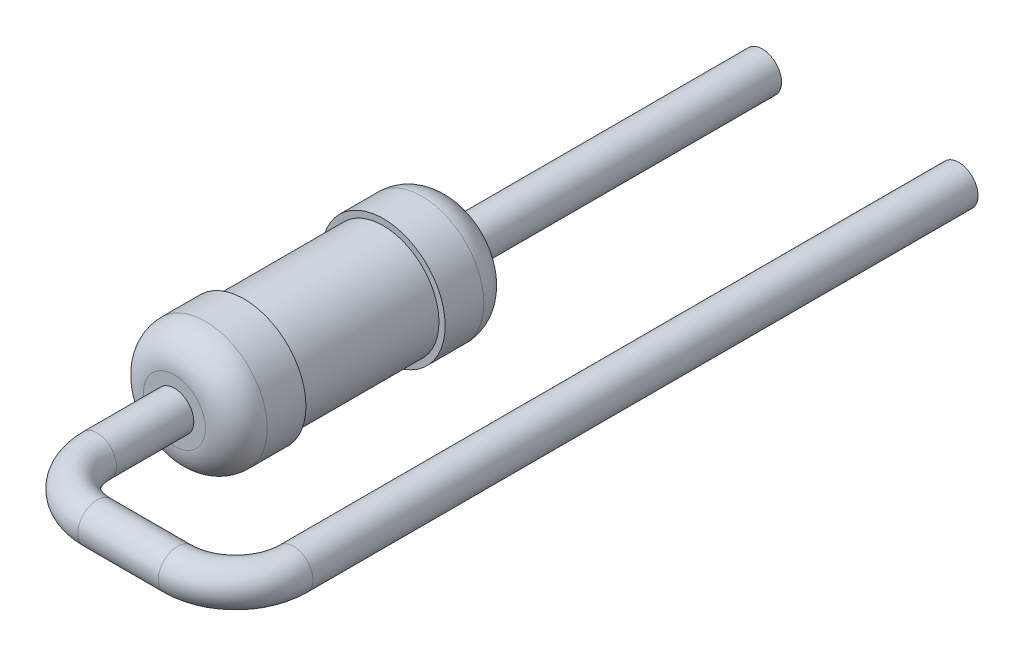
ISO-10303-21;
HEADER;
FILE_DESCRIPTION(('STEP AP214'),'2;1');
FILE_NAME('part.step','',(''),(''),'','','');
FILE_SCHEMA(('AUTOMOTIVE_DESIGN { 1 0 10303 214 1 1 1 1 }'));
ENDSEC;
DATA;
#1=APPLICATION_CONTEXT('core data for automotive mechanical design processes');
#2=APPLICATION_PROTOCOL_DEFINITION('international standard','automotive_design',2000,#1);
#3=PRODUCT_CONTEXT('',#1,'mechanical');
#4=PRODUCT('Part','Part','',(#3));
#5=PRODUCT_RELATED_PRODUCT_CATEGORY('part','',(#4));
#6=PRODUCT_DEFINITION_FORMATION('','',#4);
#7=PRODUCT_DEFINITION_CONTEXT('part definition',#1,'design');
#8=PRODUCT_DEFINITION('design','',#6,#7);
#9=PRODUCT_DEFINITION_SHAPE('','',#8);
#10=(LENGTH_UNIT() NAMED_UNIT(*) SI_UNIT(.MILLI.,.METRE.));
#11=(NAMED_UNIT(*) PLANE_ANGLE_UNIT() SI_UNIT($,.RADIAN.));
#12=(NAMED_UNIT(*) SI_UNIT($,.STERADIAN.) SOLID_ANGLE_UNIT());
#13=UNCERTAINTY_MEASURE_WITH_UNIT(LENGTH_MEASURE(1.E-05),#10,'distance_accuracy_value','');
#14=(GEOMETRIC_REPRESENTATION_CONTEXT(3) GLOBAL_UNCERTAINTY_ASSIGNED_CONTEXT((#13)) GLOBAL_UNIT_ASSIGNED_CONTEXT((#10,
#11,#12)) REPRESENTATION_CONTEXT('',''));
#15=CARTESIAN_POINT('',(0.,0.,0.));
#16=DIRECTION('',(0.,0.,1.));
#17=DIRECTION('',(1.,0.,0.));
#18=AXIS2_PLACEMENT_3D('',#15,#16,#17);
#19=CARTESIAN_POINT('',(2.29,0.,-3.));
#20=DIRECTION('',(0.,0.,1.));
#21=DIRECTION('',(1.,0.,0.));
#22=AXIS2_PLACEMENT_3D('',#19,#20,#21);
#23=PLANE('',#22);
#24=CARTESIAN_POINT('',(2.54,0.,-3.));
#25=DIRECTION('',(0.,0.,-1.));
#26=DIRECTION('',(-1.,0.,0.));
#27=AXIS2_PLACEMENT_3D('',#24,#25,#26);
#28=CIRCLE('',#27,0.25);
#29=CARTESIAN_POINT('',(2.29,0.,-3.));
#30=VERTEX_POINT('',#29);
#31=EDGE_CURVE('E11',#30,#30,#28,.T.);
#32=ORIENTED_EDGE('',*,*,#31,.T.);
#33=EDGE_LOOP('',(#32));
#34=FACE_BOUND('',#33,.T.);
#35=ADVANCED_FACE('F17',(#34),#23,.F.);
#36=CARTESIAN_POINT('',(2.54,0.,5.6));
#37=DIRECTION('',(0.,0.,-1.));
#38=DIRECTION('',(-1.,0.,0.));
#39=AXIS2_PLACEMENT_3D('',#36,#37,#38);
#40=CYLINDRICAL_SURFACE('',#39,0.25);
#41=DIRECTION('',(0.,0.,-1.));
#42=VECTOR('',#41,1.);
#43=CARTESIAN_POINT('',(2.29,0.,5.6));
#44=LINE('',#43,#42);
#45=CARTESIAN_POINT('',(2.29,0.,5.6));
#46=VERTEX_POINT('',#45);
#47=EDGE_CURVE('E21',#46,#30,#44,.T.);
#48=ORIENTED_EDGE('',*,*,#47,.T.);
#49=ORIENTED_EDGE('',*,*,#31,.F.);
#50=ORIENTED_EDGE('',*,*,#47,.F.);
#51=CARTESIAN_POINT('',(2.54,0.,5.6));
#52=DIRECTION('',(0.,0.,1.));
#53=DIRECTION('',(1.,0.,0.));
#54=AXIS2_PLACEMENT_3D('',#51,#52,#53);
#55=CIRCLE('',#54,0.25);
#56=EDGE_CURVE('E122',#46,#46,#55,.T.);
#57=ORIENTED_EDGE('',*,*,#56,.F.);
#58=EDGE_LOOP('',(#48,#49,#50,#57));
#59=FACE_BOUND('',#58,.T.);
#60=ADVANCED_FACE('F239',(#59),#40,.T.);
#61=CARTESIAN_POINT('',(1.79,0.,5.6));
#62=DIRECTION('',(0.,1.,0.));
#63=DIRECTION('',(0.,0.,1.));
#64=AXIS2_PLACEMENT_3D('',#61,#62,#63);
#65=TOROIDAL_SURFACE('',#64,0.75,0.25);
#66=CARTESIAN_POINT('',(1.79,0.,5.6));
#67=DIRECTION('',(0.,1.,0.));
#68=DIRECTION('',(0.,0.,1.));
#69=AXIS2_PLACEMENT_3D('',#66,#67,#68);
#70=CIRCLE('',#69,0.5);
#71=CARTESIAN_POINT('',(1.79,0.,6.1));
#72=VERTEX_POINT('',#71);
#73=EDGE_CURVE('E119',#72,#46,#70,.T.);
#74=ORIENTED_EDGE('',*,*,#73,.T.);
#75=ORIENTED_EDGE('',*,*,#56,.T.);
#76=ORIENTED_EDGE('',*,*,#73,.F.);
#77=CARTESIAN_POINT('',(1.79,0.,6.35));
#78=DIRECTION('',(1.,0.,0.));
#79=DIRECTION('',(0.,0.,-1.));
#80=AXIS2_PLACEMENT_3D('',#77,#78,#79);
#81=CIRCLE('',#80,0.25);
#82=EDGE_CURVE('E123',#72,#72,#81,.T.);
#83=ORIENTED_EDGE('',*,*,#82,.T.);
#84=EDGE_LOOP('',(#74,#75,#76,#83));
#85=FACE_BOUND('',#84,.T.);
#86=ADVANCED_FACE('F183',(#85),#65,.T.);
#87=CARTESIAN_POINT('',(0.75,0.,6.35));
#88=DIRECTION('',(1.,0.,0.));
#89=DIRECTION('',(0.,0.,-1.));
#90=AXIS2_PLACEMENT_3D('',#87,#88,#89);
#91=CYLINDRICAL_SURFACE('',#90,0.25);
#92=DIRECTION('',(1.,0.,0.));
#93=VECTOR('',#92,1.);
#94=CARTESIAN_POINT('',(0.75,0.,6.1));
#95=LINE('',#94,#93);
#96=CARTESIAN_POINT('',(0.75,0.,6.1));
#97=VERTEX_POINT('',#96);
#98=EDGE_CURVE('E166',#97,#72,#95,.T.);
#99=ORIENTED_EDGE('',*,*,#98,.T.);
#100=ORIENTED_EDGE('',*,*,#82,.F.);
#101=ORIENTED_EDGE('',*,*,#98,.F.);
#102=CARTESIAN_POINT('',(0.75,0.,6.35));
#103=DIRECTION('',(-1.,0.,0.));
#104=DIRECTION('',(0.,0.,1.));
#105=AXIS2_PLACEMENT_3D('',#102,#103,#104);
#106=CIRCLE('',#105,0.25);
#107=EDGE_CURVE('E162',#97,#97,#106,.T.);
#108=ORIENTED_EDGE('',*,*,#107,.F.);
#109=EDGE_LOOP('',(#99,#100,#101,#108));
#110=FACE_BOUND('',#109,.T.);
#111=ADVANCED_FACE('F185',(#110),#91,.T.);
#112=CARTESIAN_POINT('',(0.75,0.,5.6));
#113=DIRECTION('',(0.,1.,0.));
#114=DIRECTION('',(-1.,0.,0.));
#115=AXIS2_PLACEMENT_3D('',#112,#113,#114);
#116=TOROIDAL_SURFACE('',#115,0.75,0.25);
#117=CARTESIAN_POINT('',(0.75,0.,5.6));
#118=DIRECTION('',(0.,1.,0.));
#119=DIRECTION('',(-1.,0.,0.));
#120=AXIS2_PLACEMENT_3D('',#117,#118,#119);
#121=CIRCLE('',#120,0.5);
#122=CARTESIAN_POINT('',(0.25,0.,5.6));
#123=VERTEX_POINT('',#122);
#124=EDGE_CURVE('E135',#123,#97,#121,.T.);
#125=ORIENTED_EDGE('',*,*,#124,.T.);
#126=ORIENTED_EDGE('',*,*,#107,.T.);
#127=ORIENTED_EDGE('',*,*,#124,.F.);
#128=CARTESIAN_POINT('',(0.,0.,5.6));
#129=DIRECTION('',(0.,0.,1.));
#130=DIRECTION('',(1.,0.,0.));
#131=AXIS2_PLACEMENT_3D('',#128,#129,#130);
#132=CIRCLE('',#131,0.25);
#133=EDGE_CURVE('E132',#123,#123,#132,.T.);
#134=ORIENTED_EDGE('',*,*,#133,.T.);
#135=EDGE_LOOP('',(#125,#126,#127,#134));
#136=FACE_BOUND('',#135,.T.);
#137=ADVANCED_FACE('F188',(#136),#116,.T.);
#138=CARTESIAN_POINT('',(0.,0.,-3.));
#139=DIRECTION('',(0.,0.,1.));
#140=DIRECTION('',(1.,0.,0.));
#141=AXIS2_PLACEMENT_3D('',#138,#139,#140);
#142=CYLINDRICAL_SURFACE('',#141,0.25);
#143=CARTESIAN_POINT('',(0.,0.,4.6));
#144=DIRECTION('',(0.,0.,1.));
#145=DIRECTION('',(1.,0.,0.));
#146=AXIS2_PLACEMENT_3D('',#143,#144,#145);
#147=CIRCLE('',#146,0.25);
#148=CARTESIAN_POINT('',(0.25,0.,4.6));
#149=VERTEX_POINT('',#148);
#150=EDGE_CURVE('E152',#149,#149,#147,.T.);
#151=ORIENTED_EDGE('',*,*,#150,.T.);
#152=DIRECTION('',(0.,0.,1.));
#153=VECTOR('',#152,1.);
#154=CARTESIAN_POINT('',(0.25,0.,-3.));
#155=LINE('',#154,#153);
#156=EDGE_CURVE('E136',#149,#123,#155,.T.);
#157=ORIENTED_EDGE('',*,*,#156,.T.);
#158=ORIENTED_EDGE('',*,*,#133,.F.);
#159=ORIENTED_EDGE('',*,*,#156,.F.);
#160=EDGE_LOOP('',(#151,#157,#158,#159));
#161=FACE_BOUND('',#160,.T.);
#162=ADVANCED_FACE('F192',(#161),#142,.T.);
#163=CARTESIAN_POINT('',(0.8,0.,4.6));
#164=DIRECTION('',(0.,0.,-1.));
#165=DIRECTION('',(0.,-1.,0.));
#166=AXIS2_PLACEMENT_3D('',#163,#164,#165);
#167=PLANE('',#166);
#168=ORIENTED_EDGE('',*,*,#150,.F.);
#169=EDGE_LOOP('',(#168));
#170=FACE_BOUND('',#169,.T.);
#171=CARTESIAN_POINT('',(0.,0.,4.6));
#172=DIRECTION('',(0.,0.,1.));
#173=DIRECTION('',(1.,0.,0.));
#174=AXIS2_PLACEMENT_3D('',#171,#172,#173);
#175=CIRCLE('',#174,0.4);
#176=CARTESIAN_POINT('',(0.4,0.,4.6));
#177=VERTEX_POINT('',#176);
#178=EDGE_CURVE('E196',#177,#177,#175,.T.);
#179=ORIENTED_EDGE('',*,*,#178,.T.);
#180=EDGE_LOOP('',(#179));
#181=FACE_BOUND('',#180,.T.);
#182=ADVANCED_FACE('F260',(#170,#181),#167,.F.);
#183=CARTESIAN_POINT('',(0.,0.,4.2));
#184=DIRECTION('',(0.,0.,1.));
#185=DIRECTION('',(1.,0.,0.));
#186=AXIS2_PLACEMENT_3D('',#183,#184,#185);
#187=DEGENERATE_TOROIDAL_SURFACE('',#186,0.4,0.4,.T.);
#188=CARTESIAN_POINT('',(0.4,0.,4.2));
#189=DIRECTION('',(0.,-1.,0.));
#190=DIRECTION('',(1.,0.,0.));
#191=AXIS2_PLACEMENT_3D('',#188,#189,#190);
#192=CIRCLE('',#191,0.4);
#193=CARTESIAN_POINT('',(0.8,0.,4.2));
#194=VERTEX_POINT('',#193);
#195=EDGE_CURVE('E171',#194,#177,#192,.T.);
#196=ORIENTED_EDGE('',*,*,#195,.F.);
#197=CARTESIAN_POINT('',(0.,0.,4.2));
#198=DIRECTION('',(0.,0.,1.));
#199=DIRECTION('',(1.,0.,0.));
#200=AXIS2_PLACEMENT_3D('',#197,#198,#199);
#201=CIRCLE('',#200,0.8);
#202=EDGE_CURVE('E167',#194,#194,#201,.T.);
#203=ORIENTED_EDGE('',*,*,#202,.T.);
#204=ORIENTED_EDGE('',*,*,#195,.T.);
#205=ORIENTED_EDGE('',*,*,#178,.F.);
#206=EDGE_LOOP('',(#196,#203,#204,#205));
#207=FACE_BOUND('',#206,.T.);
#208=ADVANCED_FACE('F263',(#207),#187,.T.);
#209=CARTESIAN_POINT('',(0.,0.,3.7));
#210=DIRECTION('',(0.,0.,-1.));
#211=DIRECTION('',(1.,0.,0.));
#212=AXIS2_PLACEMENT_3D('',#209,#210,#211);
#213=CYLINDRICAL_SURFACE('',#212,0.8);
#214=CARTESIAN_POINT('',(0.,0.,3.7));
#215=DIRECTION('',(0.,0.,1.));
#216=DIRECTION('',(1.,0.,0.));
#217=AXIS2_PLACEMENT_3D('',#214,#215,#216);
#218=CIRCLE('',#217,0.8);
#219=CARTESIAN_POINT('',(0.8,0.,3.7));
#220=VERTEX_POINT('',#219);
#221=EDGE_CURVE('E117',#220,#220,#218,.T.);
#222=ORIENTED_EDGE('',*,*,#221,.T.);
#223=DIRECTION('',(0.,0.,1.));
#224=VECTOR('',#223,1.);
#225=CARTESIAN_POINT('',(0.8,0.,3.7));
#226=LINE('',#225,#224);
#227=EDGE_CURVE('E172',#220,#194,#226,.T.);
#228=ORIENTED_EDGE('',*,*,#227,.T.);
#229=ORIENTED_EDGE('',*,*,#202,.F.);
#230=ORIENTED_EDGE('',*,*,#227,.F.);
#231=EDGE_LOOP('',(#222,#228,#229,#230));
#232=FACE_BOUND('',#231,.T.);
#233=ADVANCED_FACE('F219',(#232),#213,.T.);
#234=CARTESIAN_POINT('',(0.25,0.,-3.));
#235=DIRECTION('',(0.,0.,-1.));
#236=DIRECTION('',(0.,-1.,0.));
#237=AXIS2_PLACEMENT_3D('',#234,#235,#236);
#238=PLANE('',#237);
#239=CARTESIAN_POINT('',(0.,0.,-3.));
#240=DIRECTION('',(0.,0.,1.));
#241=DIRECTION('',(1.,0.,0.));
#242=AXIS2_PLACEMENT_3D('',#239,#240,#241);
#243=CIRCLE('',#242,0.25);
#244=CARTESIAN_POINT('',(0.25,0.,-3.));
#245=VERTEX_POINT('',#244);
#246=EDGE_CURVE('E103',#245,#245,#243,.T.);
#247=ORIENTED_EDGE('',*,*,#246,.F.);
#248=EDGE_LOOP('',(#247));
#249=FACE_BOUND('',#248,.T.);
#250=ADVANCED_FACE('F224',(#249),#238,.T.);
#251=CARTESIAN_POINT('',(0.8,0.,3.7));
#252=DIRECTION('',(0.,0.,-1.));
#253=DIRECTION('',(0.,-1.,0.));
#254=AXIS2_PLACEMENT_3D('',#251,#252,#253);
#255=PLANE('',#254);
#256=CARTESIAN_POINT('',(0.,0.,3.7));
#257=DIRECTION('',(0.,0.,-1.));
#258=DIRECTION('',(1.,0.,0.));
#259=AXIS2_PLACEMENT_3D('',#256,#257,#258);
#260=CIRCLE('',#259,0.72);
#261=CARTESIAN_POINT('',(0.72,0.,3.7));
#262=VERTEX_POINT('',#261);
#263=EDGE_CURVE('E99',#262,#262,#260,.T.);
#264=ORIENTED_EDGE('',*,*,#263,.F.);
#265=EDGE_LOOP('',(#264));
#266=FACE_BOUND('',#265,.T.);
#267=ORIENTED_EDGE('',*,*,#221,.F.);
#268=EDGE_LOOP('',(#267));
#269=FACE_BOUND('',#268,.T.);
#270=ADVANCED_FACE('F221',(#266,#269),#255,.T.);
#271=CARTESIAN_POINT('',(0.,0.,-3.));
#272=DIRECTION('',(0.,0.,1.));
#273=DIRECTION('',(1.,0.,0.));
#274=AXIS2_PLACEMENT_3D('',#271,#272,#273);
#275=CYLINDRICAL_SURFACE('',#274,0.25);
#276=ORIENTED_EDGE('',*,*,#246,.T.);
#277=DIRECTION('',(0.,0.,1.));
#278=VECTOR('',#277,1.);
#279=CARTESIAN_POINT('',(0.25,0.,-3.));
#280=LINE('',#279,#278);
#281=CARTESIAN_POINT('',(0.25,0.,1.));
#282=VERTEX_POINT('',#281);
#283=EDGE_CURVE('E110',#245,#282,#280,.T.);
#284=ORIENTED_EDGE('',*,*,#283,.T.);
#285=CARTESIAN_POINT('',(0.,0.,1.));
#286=DIRECTION('',(0.,0.,1.));
#287=DIRECTION('',(1.,0.,0.));
#288=AXIS2_PLACEMENT_3D('',#285,#286,#287);
#289=CIRCLE('',#288,0.25);
#290=EDGE_CURVE('E113',#282,#282,#289,.T.);
#291=ORIENTED_EDGE('',*,*,#290,.F.);
#292=ORIENTED_EDGE('',*,*,#283,.F.);
#293=EDGE_LOOP('',(#276,#284,#291,#292));
#294=FACE_BOUND('',#293,.T.);
#295=ADVANCED_FACE('F223',(#294),#275,.T.);
#296=CARTESIAN_POINT('',(0.,0.,1.));
#297=DIRECTION('',(0.,0.,-1.));
#298=DIRECTION('',(1.,0.,0.));
#299=AXIS2_PLACEMENT_3D('',#296,#297,#298);
#300=CYLINDRICAL_SURFACE('',#299,0.72);
#301=ORIENTED_EDGE('',*,*,#263,.T.);
#302=DIRECTION('',(0.,0.,1.));
#303=VECTOR('',#302,1.);
#304=CARTESIAN_POINT('',(0.72,0.,1.));
#305=LINE('',#304,#303);
#306=CARTESIAN_POINT('',(0.72,0.,1.9));
#307=VERTEX_POINT('',#306);
#308=EDGE_CURVE('E96',#307,#262,#305,.T.);
#309=ORIENTED_EDGE('',*,*,#308,.F.);
#310=CARTESIAN_POINT('',(0.,0.,1.9));
#311=DIRECTION('',(0.,0.,-1.));
#312=DIRECTION('',(1.,0.,0.));
#313=AXIS2_PLACEMENT_3D('',#310,#311,#312);
#314=CIRCLE('',#313,0.72);
#315=EDGE_CURVE('E101',#307,#307,#314,.T.);
#316=ORIENTED_EDGE('',*,*,#315,.F.);
#317=ORIENTED_EDGE('',*,*,#308,.T.);
#318=EDGE_LOOP('',(#301,#309,#316,#317));
#319=FACE_BOUND('',#318,.T.);
#320=ADVANCED_FACE('F97',(#319),#300,.T.);
#321=CARTESIAN_POINT('',(0.8,0.,1.));
#322=DIRECTION('',(0.,0.,-1.));
#323=DIRECTION('',(0.,-1.,0.));
#324=AXIS2_PLACEMENT_3D('',#321,#322,#323);
#325=PLANE('',#324);
#326=ORIENTED_EDGE('',*,*,#290,.T.);
#327=EDGE_LOOP('',(#326));
#328=FACE_BOUND('',#327,.T.);
#329=CARTESIAN_POINT('',(0.,0.,1.));
#330=DIRECTION('',(0.,0.,1.));
#331=DIRECTION('',(1.,0.,0.));
#332=AXIS2_PLACEMENT_3D('',#329,#330,#331);
#333=CIRCLE('',#332,0.4);
#334=CARTESIAN_POINT('',(0.4,0.,1.));
#335=VERTEX_POINT('',#334);
#336=EDGE_CURVE('E131',#335,#335,#333,.T.);
#337=ORIENTED_EDGE('',*,*,#336,.F.);
#338=EDGE_LOOP('',(#337));
#339=FACE_BOUND('',#338,.T.);
#340=ADVANCED_FACE('F19',(#328,#339),#325,.T.);
#341=CARTESIAN_POINT('',(0.8,0.,1.9));
#342=DIRECTION('',(0.,0.,-1.));
#343=DIRECTION('',(0.,-1.,0.));
#344=AXIS2_PLACEMENT_3D('',#341,#342,#343);
#345=PLANE('',#344);
#346=ORIENTED_EDGE('',*,*,#315,.T.);
#347=EDGE_LOOP('',(#346));
#348=FACE_BOUND('',#347,.T.);
#349=CARTESIAN_POINT('',(0.,0.,1.9));
#350=DIRECTION('',(0.,0.,1.));
#351=DIRECTION('',(1.,0.,0.));
#352=AXIS2_PLACEMENT_3D('',#349,#350,#351);
#353=CIRCLE('',#352,0.8);
#354=CARTESIAN_POINT('',(0.8,0.,1.9));
#355=VERTEX_POINT('',#354);
#356=EDGE_CURVE('E157',#355,#355,#353,.T.);
#357=ORIENTED_EDGE('',*,*,#356,.T.);
#358=EDGE_LOOP('',(#357));
#359=FACE_BOUND('',#358,.T.);
#360=ADVANCED_FACE('F257',(#348,#359),#345,.F.);
#361=CARTESIAN_POINT('',(0.,0.,1.4));
#362=DIRECTION('',(0.,0.,-1.));
#363=DIRECTION('',(1.,0.,0.));
#364=AXIS2_PLACEMENT_3D('',#361,#362,#363);
#365=DEGENERATE_TOROIDAL_SURFACE('',#364,0.4,0.4,.T.);
#366=ORIENTED_EDGE('',*,*,#336,.T.);
#367=CARTESIAN_POINT('',(0.4,0.,1.4));
#368=DIRECTION('',(0.,1.,0.));
#369=DIRECTION('',(1.,0.,0.));
#370=AXIS2_PLACEMENT_3D('',#367,#368,#369);
#371=CIRCLE('',#370,0.4);
#372=CARTESIAN_POINT('',(0.8,0.,1.4));
#373=VERTEX_POINT('',#372);
#374=EDGE_CURVE('E127',#373,#335,#371,.T.);
#375=ORIENTED_EDGE('',*,*,#374,.F.);
#376=CARTESIAN_POINT('',(0.,0.,1.4));
#377=DIRECTION('',(0.,0.,1.));
#378=DIRECTION('',(1.,0.,0.));
#379=AXIS2_PLACEMENT_3D('',#376,#377,#378);
#380=CIRCLE('',#379,0.8);
#381=EDGE_CURVE('E158',#373,#373,#380,.T.);
#382=ORIENTED_EDGE('',*,*,#381,.F.);
#383=ORIENTED_EDGE('',*,*,#374,.T.);
#384=EDGE_LOOP('',(#366,#375,#382,#383));
#385=FACE_BOUND('',#384,.T.);
#386=ADVANCED_FACE('F255',(#385),#365,.T.);
#387=CARTESIAN_POINT('',(0.,0.,1.));
#388=DIRECTION('',(0.,0.,-1.));
#389=DIRECTION('',(1.,0.,0.));
#390=AXIS2_PLACEMENT_3D('',#387,#388,#389);
#391=CYLINDRICAL_SURFACE('',#390,0.8);
#392=ORIENTED_EDGE('',*,*,#381,.T.);
#393=DIRECTION('',(0.,0.,1.));
#394=VECTOR('',#393,1.);
#395=CARTESIAN_POINT('',(0.8,0.,1.));
#396=LINE('',#395,#394);
#397=EDGE_CURVE('E153',#373,#355,#396,.T.);
#398=ORIENTED_EDGE('',*,*,#397,.T.);
#399=ORIENTED_EDGE('',*,*,#356,.F.);
#400=ORIENTED_EDGE('',*,*,#397,.F.);
#401=EDGE_LOOP('',(#392,#398,#399,#400));
#402=FACE_BOUND('',#401,.T.);
#403=ADVANCED_FACE('F252',(#402),#391,.T.);
#404=CLOSED_SHELL('',(#35,#60,#86,#111,#137,#162,#182,#208,#233,#250,#270,#295,#320,#340,#360,
#386,#403));
#405=MANIFOLD_SOLID_BREP('B1',#404);
#406=ADVANCED_BREP_SHAPE_REPRESENTATION('',(#18,#405),#14);
#407=SHAPE_DEFINITION_REPRESENTATION(#9,#406);
ENDSEC;
END-ISO-10303-21;
